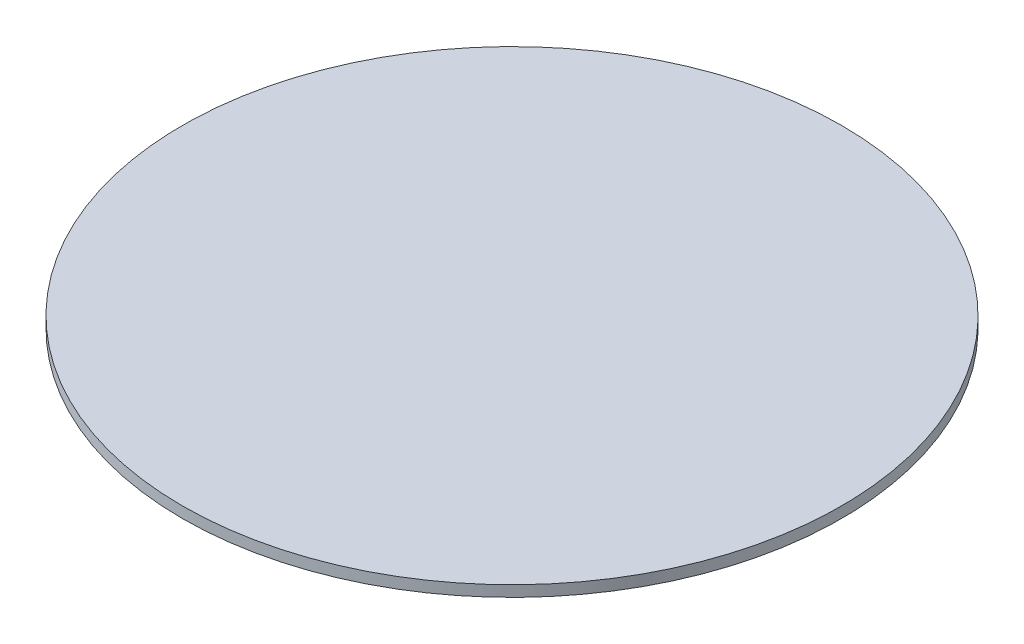
ISO-10303-21;
HEADER;
FILE_DESCRIPTION(('STEP AP214'),'2;1');
FILE_NAME('part.step','',(''),(''),'','','');
FILE_SCHEMA(('AUTOMOTIVE_DESIGN { 1 0 10303 214 1 1 1 1 }'));
ENDSEC;
DATA;
#1=APPLICATION_CONTEXT('core data for automotive mechanical design processes');
#2=APPLICATION_PROTOCOL_DEFINITION('international standard','automotive_design',2000,#1);
#3=PRODUCT_CONTEXT('',#1,'mechanical');
#4=PRODUCT('Part','Part','',(#3));
#5=PRODUCT_RELATED_PRODUCT_CATEGORY('part','',(#4));
#6=PRODUCT_DEFINITION_FORMATION('','',#4);
#7=PRODUCT_DEFINITION_CONTEXT('part definition',#1,'design');
#8=PRODUCT_DEFINITION('design','',#6,#7);
#9=PRODUCT_DEFINITION_SHAPE('','',#8);
#10=(LENGTH_UNIT() NAMED_UNIT(*) SI_UNIT(.MILLI.,.METRE.));
#11=(NAMED_UNIT(*) PLANE_ANGLE_UNIT() SI_UNIT($,.RADIAN.));
#12=(NAMED_UNIT(*) SI_UNIT($,.STERADIAN.) SOLID_ANGLE_UNIT());
#13=UNCERTAINTY_MEASURE_WITH_UNIT(LENGTH_MEASURE(1.E-05),#10,'distance_accuracy_value','');
#14=(GEOMETRIC_REPRESENTATION_CONTEXT(3) GLOBAL_UNCERTAINTY_ASSIGNED_CONTEXT((#13)) GLOBAL_UNIT_ASSIGNED_CONTEXT((#10,
#11,#12)) REPRESENTATION_CONTEXT('',''));
#15=CARTESIAN_POINT('',(0.,0.,0.));
#16=DIRECTION('',(0.,0.,1.));
#17=DIRECTION('',(1.,0.,0.));
#18=AXIS2_PLACEMENT_3D('',#15,#16,#17);
#19=CARTESIAN_POINT('',(0.,-2.,0.));
#20=DIRECTION('',(0.,1.,0.));
#21=DIRECTION('',(0.,0.,1.));
#22=AXIS2_PLACEMENT_3D('',#19,#20,#21);
#23=CYLINDRICAL_SURFACE('',#22,60.);
#24=CARTESIAN_POINT('',(0.,-2.,0.));
#25=DIRECTION('',(0.,1.,0.));
#26=DIRECTION('',(0.,0.,1.));
#27=AXIS2_PLACEMENT_3D('',#24,#25,#26);
#28=CIRCLE('',#27,60.);
#29=CARTESIAN_POINT('',(0.,-2.,60.));
#30=VERTEX_POINT('',#29);
#31=EDGE_CURVE('E10',#30,#30,#28,.T.);
#32=ORIENTED_EDGE('',*,*,#31,.T.);
#33=EDGE_LOOP('',(#32));
#34=FACE_BOUND('',#33,.T.);
#35=CARTESIAN_POINT('',(0.,0.,0.));
#36=DIRECTION('',(0.,1.,0.));
#37=DIRECTION('',(0.,0.,1.));
#38=AXIS2_PLACEMENT_3D('',#35,#36,#37);
#39=CIRCLE('',#38,60.);
#40=CARTESIAN_POINT('',(0.,0.,60.));
#41=VERTEX_POINT('',#40);
#42=EDGE_CURVE('E38',#41,#41,#39,.T.);
#43=ORIENTED_EDGE('',*,*,#42,.F.);
#44=EDGE_LOOP('',(#43));
#45=FACE_BOUND('',#44,.T.);
#46=ADVANCED_FACE('F35',(#34,#45),#23,.T.);
#47=CARTESIAN_POINT('',(0.,-2.,0.));
#48=DIRECTION('',(0.,1.,0.));
#49=DIRECTION('',(0.,0.,1.));
#50=AXIS2_PLACEMENT_3D('',#47,#48,#49);
#51=PLANE('',#50);
#52=ORIENTED_EDGE('',*,*,#31,.F.);
#53=EDGE_LOOP('',(#52));
#54=FACE_BOUND('',#53,.T.);
#55=ADVANCED_FACE('F50',(#54),#51,.F.);
#56=CARTESIAN_POINT('',(0.,0.,0.));
#57=DIRECTION('',(0.,1.,0.));
#58=DIRECTION('',(0.,0.,1.));
#59=AXIS2_PLACEMENT_3D('',#56,#57,#58);
#60=PLANE('',#59);
#61=ORIENTED_EDGE('',*,*,#42,.T.);
#62=EDGE_LOOP('',(#61));
#63=FACE_BOUND('',#62,.T.);
#64=ADVANCED_FACE('F47',(#63),#60,.T.);
#65=CLOSED_SHELL('',(#46,#55,#64));
#66=MANIFOLD_SOLID_BREP('B2',#65);
#67=ADVANCED_BREP_SHAPE_REPRESENTATION('',(#18,#66),#14);
#68=SHAPE_DEFINITION_REPRESENTATION(#9,#67);
ENDSEC;
END-ISO-10303-21;
